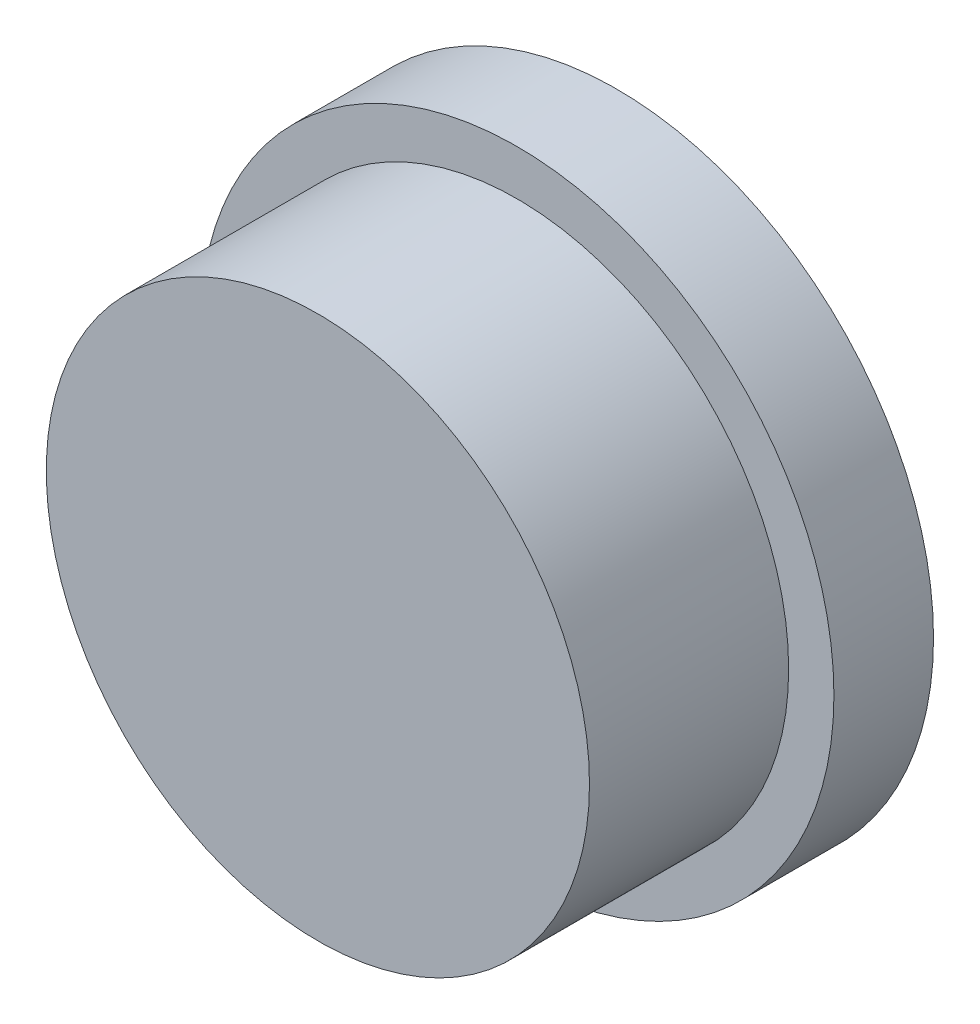
ISO-10303-21;
HEADER;
FILE_DESCRIPTION(('STEP AP214'),'2;1');
FILE_NAME('part.step','',(''),(''),'','','');
FILE_SCHEMA(('AUTOMOTIVE_DESIGN { 1 0 10303 214 1 1 1 1 }'));
ENDSEC;
DATA;
#1=APPLICATION_CONTEXT('core data for automotive mechanical design processes');
#2=APPLICATION_PROTOCOL_DEFINITION('international standard','automotive_design',2000,#1);
#3=PRODUCT_CONTEXT('',#1,'mechanical');
#4=PRODUCT('Part','Part','',(#3));
#5=PRODUCT_RELATED_PRODUCT_CATEGORY('part','',(#4));
#6=PRODUCT_DEFINITION_FORMATION('','',#4);
#7=PRODUCT_DEFINITION_CONTEXT('part definition',#1,'design');
#8=PRODUCT_DEFINITION('design','',#6,#7);
#9=PRODUCT_DEFINITION_SHAPE('','',#8);
#10=(LENGTH_UNIT() NAMED_UNIT(*) SI_UNIT(.MILLI.,.METRE.));
#11=(NAMED_UNIT(*) PLANE_ANGLE_UNIT() SI_UNIT($,.RADIAN.));
#12=(NAMED_UNIT(*) SI_UNIT($,.STERADIAN.) SOLID_ANGLE_UNIT());
#13=UNCERTAINTY_MEASURE_WITH_UNIT(LENGTH_MEASURE(1.E-05),#10,'distance_accuracy_value','');
#14=(GEOMETRIC_REPRESENTATION_CONTEXT(3) GLOBAL_UNCERTAINTY_ASSIGNED_CONTEXT((#13)) GLOBAL_UNIT_ASSIGNED_CONTEXT((#10,
#11,#12)) REPRESENTATION_CONTEXT('',''));
#15=CARTESIAN_POINT('',(0.,0.,0.));
#16=DIRECTION('',(0.,0.,1.));
#17=DIRECTION('',(1.,0.,0.));
#18=AXIS2_PLACEMENT_3D('',#15,#16,#17);
#19=CARTESIAN_POINT('',(0.,0.,33.));
#20=DIRECTION('',(0.,0.,-1.));
#21=DIRECTION('',(-1.,0.,0.));
#22=AXIS2_PLACEMENT_3D('',#19,#20,#21);
#23=CYLINDRICAL_SURFACE('',#22,30.);
#24=CARTESIAN_POINT('',(0.,0.,33.));
#25=DIRECTION('',(0.,0.,1.));
#26=DIRECTION('',(1.,0.,0.));
#27=AXIS2_PLACEMENT_3D('',#24,#25,#26);
#28=CIRCLE('',#27,30.);
#29=CARTESIAN_POINT('',(30.,0.,33.));
#30=VERTEX_POINT('',#29);
#31=EDGE_CURVE('E11',#30,#30,#28,.T.);
#32=ORIENTED_EDGE('',*,*,#31,.F.);
#33=EDGE_LOOP('',(#32));
#34=FACE_BOUND('',#33,.T.);
#35=CARTESIAN_POINT('',(0.,0.,11.));
#36=DIRECTION('',(0.,0.,1.));
#37=DIRECTION('',(1.,0.,0.));
#38=AXIS2_PLACEMENT_3D('',#35,#36,#37);
#39=CIRCLE('',#38,30.);
#40=CARTESIAN_POINT('',(30.,0.,11.));
#41=VERTEX_POINT('',#40);
#42=EDGE_CURVE('E43',#41,#41,#39,.T.);
#43=ORIENTED_EDGE('',*,*,#42,.T.);
#44=EDGE_LOOP('',(#43));
#45=FACE_BOUND('',#44,.T.);
#46=ADVANCED_FACE('F40',(#34,#45),#23,.T.);
#47=CARTESIAN_POINT('',(0.,0.,33.));
#48=DIRECTION('',(0.,0.,1.));
#49=DIRECTION('',(1.,0.,0.));
#50=AXIS2_PLACEMENT_3D('',#47,#48,#49);
#51=PLANE('',#50);
#52=ORIENTED_EDGE('',*,*,#31,.T.);
#53=EDGE_LOOP('',(#52));
#54=FACE_BOUND('',#53,.T.);
#55=ADVANCED_FACE('F55',(#54),#51,.T.);
#56=CARTESIAN_POINT('',(0.,0.,11.));
#57=DIRECTION('',(0.,0.,1.));
#58=DIRECTION('',(1.,0.,0.));
#59=AXIS2_PLACEMENT_3D('',#56,#57,#58);
#60=PLANE('',#59);
#61=ORIENTED_EDGE('',*,*,#42,.F.);
#62=EDGE_LOOP('',(#61));
#63=FACE_BOUND('',#62,.T.);
#64=ADVANCED_FACE('F53',(#63),#60,.F.);
#65=CLOSED_SHELL('',(#46,#55,#64));
#66=MANIFOLD_SOLID_BREP('B2',#65);
#67=CARTESIAN_POINT('',(0.,0.,11.));
#68=DIRECTION('',(0.,0.,1.));
#69=DIRECTION('',(1.,0.,0.));
#70=AXIS2_PLACEMENT_3D('',#67,#68,#69);
#71=PLANE('',#70);
#72=CARTESIAN_POINT('',(0.,0.,11.));
#73=DIRECTION('',(0.,0.,1.));
#74=DIRECTION('',(1.,0.,0.));
#75=AXIS2_PLACEMENT_3D('',#72,#73,#74);
#76=CIRCLE('',#75,35.);
#77=CARTESIAN_POINT('',(35.,0.,11.));
#78=VERTEX_POINT('',#77);
#79=EDGE_CURVE('E39',#78,#78,#76,.T.);
#80=ORIENTED_EDGE('',*,*,#79,.T.);
#81=EDGE_LOOP('',(#80));
#82=FACE_BOUND('',#81,.T.);
#83=CARTESIAN_POINT('',(0.,0.,11.));
#84=DIRECTION('',(0.,0.,1.));
#85=DIRECTION('',(1.,0.,0.));
#86=AXIS2_PLACEMENT_3D('',#83,#84,#85);
#87=CIRCLE('',#86,30.);
#88=CARTESIAN_POINT('',(30.,0.,11.));
#89=VERTEX_POINT('',#88);
#90=EDGE_CURVE('E91',#89,#89,#87,.T.);
#91=ORIENTED_EDGE('',*,*,#90,.F.);
#92=EDGE_LOOP('',(#91));
#93=FACE_BOUND('',#92,.T.);
#94=ADVANCED_FACE('F80',(#82,#93),#71,.T.);
#95=CARTESIAN_POINT('',(0.,0.,0.));
#96=DIRECTION('',(0.,0.,1.));
#97=DIRECTION('',(1.,0.,0.));
#98=AXIS2_PLACEMENT_3D('',#95,#96,#97);
#99=PLANE('',#98);
#100=CARTESIAN_POINT('',(0.,0.,0.));
#101=DIRECTION('',(0.,0.,1.));
#102=DIRECTION('',(1.,0.,0.));
#103=AXIS2_PLACEMENT_3D('',#100,#101,#102);
#104=CIRCLE('',#103,35.);
#105=CARTESIAN_POINT('',(35.,0.,0.));
#106=VERTEX_POINT('',#105);
#107=EDGE_CURVE('E84',#106,#106,#104,.T.);
#108=ORIENTED_EDGE('',*,*,#107,.F.);
#109=EDGE_LOOP('',(#108));
#110=FACE_BOUND('',#109,.T.);
#111=CARTESIAN_POINT('',(0.,0.,0.));
#112=DIRECTION('',(0.,0.,1.));
#113=DIRECTION('',(1.,0.,0.));
#114=AXIS2_PLACEMENT_3D('',#111,#112,#113);
#115=CIRCLE('',#114,30.);
#116=CARTESIAN_POINT('',(30.,0.,0.));
#117=VERTEX_POINT('',#116);
#118=EDGE_CURVE('E93',#117,#117,#115,.T.);
#119=ORIENTED_EDGE('',*,*,#118,.T.);
#120=EDGE_LOOP('',(#119));
#121=FACE_BOUND('',#120,.T.);
#122=ADVANCED_FACE('F103',(#110,#121),#99,.F.);
#123=CARTESIAN_POINT('',(0.,0.,11.));
#124=DIRECTION('',(0.,0.,-1.));
#125=DIRECTION('',(-1.,0.,0.));
#126=AXIS2_PLACEMENT_3D('',#123,#124,#125);
#127=CYLINDRICAL_SURFACE('',#126,35.);
#128=ORIENTED_EDGE('',*,*,#79,.F.);
#129=EDGE_LOOP('',(#128));
#130=FACE_BOUND('',#129,.T.);
#131=ORIENTED_EDGE('',*,*,#107,.T.);
#132=EDGE_LOOP('',(#131));
#133=FACE_BOUND('',#132,.T.);
#134=ADVANCED_FACE('F82',(#130,#133),#127,.T.);
#135=CARTESIAN_POINT('',(0.,0.,11.));
#136=DIRECTION('',(0.,0.,-1.));
#137=DIRECTION('',(-1.,0.,0.));
#138=AXIS2_PLACEMENT_3D('',#135,#136,#137);
#139=CYLINDRICAL_SURFACE('',#138,30.);
#140=ORIENTED_EDGE('',*,*,#90,.T.);
#141=EDGE_LOOP('',(#140));
#142=FACE_BOUND('',#141,.T.);
#143=ORIENTED_EDGE('',*,*,#118,.F.);
#144=EDGE_LOOP('',(#143));
#145=FACE_BOUND('',#144,.T.);
#146=ADVANCED_FACE('F99',(#142,#145),#139,.F.);
#147=CLOSED_SHELL('',(#94,#122,#134,#146));
#148=MANIFOLD_SOLID_BREP('B6',#147);
#149=ADVANCED_BREP_SHAPE_REPRESENTATION('',(#18,#66,#148),#14);
#150=SHAPE_DEFINITION_REPRESENTATION(#9,#149);
ENDSEC;
END-ISO-10303-21;
